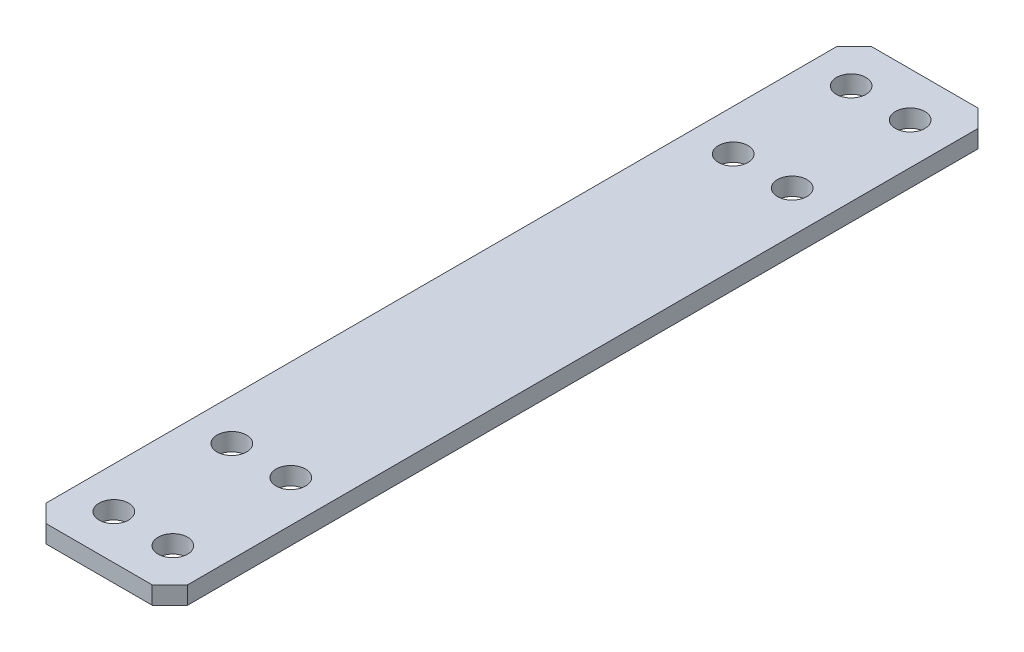
ISO-10303-21;
HEADER;
FILE_DESCRIPTION(('STEP AP214'),'2;1');
FILE_NAME('part.step','',(''),(''),'','','');
FILE_SCHEMA(('AUTOMOTIVE_DESIGN { 1 0 10303 214 1 1 1 1 }'));
ENDSEC;
DATA;
#1=APPLICATION_CONTEXT('core data for automotive mechanical design processes');
#2=APPLICATION_PROTOCOL_DEFINITION('international standard','automotive_design',2000,#1);
#3=PRODUCT_CONTEXT('',#1,'mechanical');
#4=PRODUCT('Part','Part','',(#3));
#5=PRODUCT_RELATED_PRODUCT_CATEGORY('part','',(#4));
#6=PRODUCT_DEFINITION_FORMATION('','',#4);
#7=PRODUCT_DEFINITION_CONTEXT('part definition',#1,'design');
#8=PRODUCT_DEFINITION('design','',#6,#7);
#9=PRODUCT_DEFINITION_SHAPE('','',#8);
#10=(LENGTH_UNIT() NAMED_UNIT(*) SI_UNIT(.MILLI.,.METRE.));
#11=(NAMED_UNIT(*) PLANE_ANGLE_UNIT() SI_UNIT($,.RADIAN.));
#12=(NAMED_UNIT(*) SI_UNIT($,.STERADIAN.) SOLID_ANGLE_UNIT());
#13=UNCERTAINTY_MEASURE_WITH_UNIT(LENGTH_MEASURE(1.E-05),#10,'distance_accuracy_value','');
#14=(GEOMETRIC_REPRESENTATION_CONTEXT(3) GLOBAL_UNCERTAINTY_ASSIGNED_CONTEXT((#13)) GLOBAL_UNIT_ASSIGNED_CONTEXT((#10,
#11,#12)) REPRESENTATION_CONTEXT('',''));
#15=CARTESIAN_POINT('',(0.,0.,0.));
#16=DIRECTION('',(0.,0.,1.));
#17=DIRECTION('',(1.,0.,0.));
#18=AXIS2_PLACEMENT_3D('',#15,#16,#17);
#19=CARTESIAN_POINT('',(-9.,0.,-70.));
#20=DIRECTION('',(-0.707106781186548,0.,-0.707106781186547));
#21=DIRECTION('',(-0.707106781186547,0.,0.707106781186548));
#22=AXIS2_PLACEMENT_3D('',#19,#20,#21);
#23=PLANE('',#22);
#24=DIRECTION('',(-0.707106781186547,0.,0.707106781186548));
#25=VECTOR('',#24,1.);
#26=CARTESIAN_POINT('',(-9.,3.,-70.));
#27=LINE('',#26,#25);
#28=CARTESIAN_POINT('',(-9.,3.,-70.));
#29=VERTEX_POINT('',#28);
#30=CARTESIAN_POINT('',(-12.,3.,-67.));
#31=VERTEX_POINT('',#30);
#32=EDGE_CURVE('E134',#29,#31,#27,.T.);
#33=ORIENTED_EDGE('',*,*,#32,.F.);
#34=DIRECTION('',(0.,1.,0.));
#35=VECTOR('',#34,1.);
#36=CARTESIAN_POINT('',(-9.,0.,-70.));
#37=LINE('',#36,#35);
#38=CARTESIAN_POINT('',(-9.,0.,-70.));
#39=VERTEX_POINT('',#38);
#40=EDGE_CURVE('E11',#39,#29,#37,.T.);
#41=ORIENTED_EDGE('',*,*,#40,.F.);
#42=DIRECTION('',(-0.707106781186547,0.,0.707106781186548));
#43=VECTOR('',#42,1.);
#44=CARTESIAN_POINT('',(-9.,0.,-70.));
#45=LINE('',#44,#43);
#46=CARTESIAN_POINT('',(-12.,0.,-67.));
#47=VERTEX_POINT('',#46);
#48=EDGE_CURVE('E155',#39,#47,#45,.T.);
#49=ORIENTED_EDGE('',*,*,#48,.T.);
#50=DIRECTION('',(0.,1.,0.));
#51=VECTOR('',#50,1.);
#52=CARTESIAN_POINT('',(-12.,0.,-67.));
#53=LINE('',#52,#51);
#54=EDGE_CURVE('E40',#47,#31,#53,.T.);
#55=ORIENTED_EDGE('',*,*,#54,.T.);
#56=EDGE_LOOP('',(#33,#41,#49,#55));
#57=FACE_BOUND('',#56,.T.);
#58=ADVANCED_FACE('F37',(#57),#23,.T.);
#59=CARTESIAN_POINT('',(9.,0.,-70.));
#60=DIRECTION('',(0.,0.,-1.));
#61=DIRECTION('',(-1.,0.,0.));
#62=AXIS2_PLACEMENT_3D('',#59,#60,#61);
#63=PLANE('',#62);
#64=DIRECTION('',(-1.,0.,0.));
#65=VECTOR('',#64,1.);
#66=CARTESIAN_POINT('',(9.,3.,-70.));
#67=LINE('',#66,#65);
#68=CARTESIAN_POINT('',(9.,3.,-70.));
#69=VERTEX_POINT('',#68);
#70=EDGE_CURVE('E153',#69,#29,#67,.T.);
#71=ORIENTED_EDGE('',*,*,#70,.F.);
#72=DIRECTION('',(0.,1.,0.));
#73=VECTOR('',#72,1.);
#74=CARTESIAN_POINT('',(9.,0.,-70.));
#75=LINE('',#74,#73);
#76=CARTESIAN_POINT('',(9.,0.,-70.));
#77=VERTEX_POINT('',#76);
#78=EDGE_CURVE('E46',#77,#69,#75,.T.);
#79=ORIENTED_EDGE('',*,*,#78,.F.);
#80=DIRECTION('',(-1.,0.,0.));
#81=VECTOR('',#80,1.);
#82=CARTESIAN_POINT('',(9.,0.,-70.));
#83=LINE('',#82,#81);
#84=EDGE_CURVE('E124',#77,#39,#83,.T.);
#85=ORIENTED_EDGE('',*,*,#84,.T.);
#86=ORIENTED_EDGE('',*,*,#40,.T.);
#87=EDGE_LOOP('',(#71,#79,#85,#86));
#88=FACE_BOUND('',#87,.T.);
#89=ADVANCED_FACE('F167',(#88),#63,.T.);
#90=CARTESIAN_POINT('',(12.,0.,-67.));
#91=DIRECTION('',(0.707106781186548,0.,-0.707106781186547));
#92=DIRECTION('',(-0.707106781186547,0.,-0.707106781186548));
#93=AXIS2_PLACEMENT_3D('',#90,#91,#92);
#94=PLANE('',#93);
#95=DIRECTION('',(-0.707106781186547,0.,-0.707106781186548));
#96=VECTOR('',#95,1.);
#97=CARTESIAN_POINT('',(12.,3.,-67.));
#98=LINE('',#97,#96);
#99=CARTESIAN_POINT('',(12.,3.,-67.));
#100=VERTEX_POINT('',#99);
#101=EDGE_CURVE('E111',#100,#69,#98,.T.);
#102=ORIENTED_EDGE('',*,*,#101,.F.);
#103=DIRECTION('',(0.,1.,0.));
#104=VECTOR('',#103,1.);
#105=CARTESIAN_POINT('',(12.,0.,-67.));
#106=LINE('',#105,#104);
#107=CARTESIAN_POINT('',(12.,0.,-67.));
#108=VERTEX_POINT('',#107);
#109=EDGE_CURVE('E106',#108,#100,#106,.T.);
#110=ORIENTED_EDGE('',*,*,#109,.F.);
#111=DIRECTION('',(-0.707106781186547,0.,-0.707106781186548));
#112=VECTOR('',#111,1.);
#113=CARTESIAN_POINT('',(12.,0.,-67.));
#114=LINE('',#113,#112);
#115=EDGE_CURVE('E109',#108,#77,#114,.T.);
#116=ORIENTED_EDGE('',*,*,#115,.T.);
#117=ORIENTED_EDGE('',*,*,#78,.T.);
#118=EDGE_LOOP('',(#102,#110,#116,#117));
#119=FACE_BOUND('',#118,.T.);
#120=ADVANCED_FACE('F108',(#119),#94,.T.);
#121=CARTESIAN_POINT('',(12.,0.,67.));
#122=DIRECTION('',(1.,0.,0.));
#123=DIRECTION('',(0.,0.,-1.));
#124=AXIS2_PLACEMENT_3D('',#121,#122,#123);
#125=PLANE('',#124);
#126=DIRECTION('',(0.,0.,-1.));
#127=VECTOR('',#126,1.);
#128=CARTESIAN_POINT('',(12.,3.,67.));
#129=LINE('',#128,#127);
#130=CARTESIAN_POINT('',(12.,3.,67.));
#131=VERTEX_POINT('',#130);
#132=EDGE_CURVE('E150',#131,#100,#129,.T.);
#133=ORIENTED_EDGE('',*,*,#132,.F.);
#134=DIRECTION('',(0.,1.,0.));
#135=VECTOR('',#134,1.);
#136=CARTESIAN_POINT('',(12.,0.,67.));
#137=LINE('',#136,#135);
#138=CARTESIAN_POINT('',(12.,0.,67.));
#139=VERTEX_POINT('',#138);
#140=EDGE_CURVE('E116',#139,#131,#137,.T.);
#141=ORIENTED_EDGE('',*,*,#140,.F.);
#142=DIRECTION('',(0.,0.,-1.));
#143=VECTOR('',#142,1.);
#144=CARTESIAN_POINT('',(12.,0.,67.));
#145=LINE('',#144,#143);
#146=EDGE_CURVE('E122',#139,#108,#145,.T.);
#147=ORIENTED_EDGE('',*,*,#146,.T.);
#148=ORIENTED_EDGE('',*,*,#109,.T.);
#149=EDGE_LOOP('',(#133,#141,#147,#148));
#150=FACE_BOUND('',#149,.T.);
#151=ADVANCED_FACE('F126',(#150),#125,.T.);
#152=CARTESIAN_POINT('',(9.,0.,70.));
#153=DIRECTION('',(0.707106781186548,0.,0.707106781186547));
#154=DIRECTION('',(0.707106781186547,0.,-0.707106781186548));
#155=AXIS2_PLACEMENT_3D('',#152,#153,#154);
#156=PLANE('',#155);
#157=DIRECTION('',(0.707106781186547,0.,-0.707106781186548));
#158=VECTOR('',#157,1.);
#159=CARTESIAN_POINT('',(9.,3.,70.));
#160=LINE('',#159,#158);
#161=CARTESIAN_POINT('',(9.,3.,70.));
#162=VERTEX_POINT('',#161);
#163=EDGE_CURVE('E147',#162,#131,#160,.T.);
#164=ORIENTED_EDGE('',*,*,#163,.F.);
#165=DIRECTION('',(0.,1.,0.));
#166=VECTOR('',#165,1.);
#167=CARTESIAN_POINT('',(9.,0.,70.));
#168=LINE('',#167,#166);
#169=CARTESIAN_POINT('',(9.,0.,70.));
#170=VERTEX_POINT('',#169);
#171=EDGE_CURVE('E159',#170,#162,#168,.T.);
#172=ORIENTED_EDGE('',*,*,#171,.F.);
#173=DIRECTION('',(0.707106781186547,0.,-0.707106781186548));
#174=VECTOR('',#173,1.);
#175=CARTESIAN_POINT('',(9.,0.,70.));
#176=LINE('',#175,#174);
#177=EDGE_CURVE('E127',#170,#139,#176,.T.);
#178=ORIENTED_EDGE('',*,*,#177,.T.);
#179=ORIENTED_EDGE('',*,*,#140,.T.);
#180=EDGE_LOOP('',(#164,#172,#178,#179));
#181=FACE_BOUND('',#180,.T.);
#182=ADVANCED_FACE('F180',(#181),#156,.T.);
#183=CARTESIAN_POINT('',(-9.,0.,70.));
#184=DIRECTION('',(0.,0.,1.));
#185=DIRECTION('',(1.,0.,0.));
#186=AXIS2_PLACEMENT_3D('',#183,#184,#185);
#187=PLANE('',#186);
#188=DIRECTION('',(1.,0.,0.));
#189=VECTOR('',#188,1.);
#190=CARTESIAN_POINT('',(-9.,3.,70.));
#191=LINE('',#190,#189);
#192=CARTESIAN_POINT('',(-9.,3.,70.));
#193=VERTEX_POINT('',#192);
#194=EDGE_CURVE('E144',#193,#162,#191,.T.);
#195=ORIENTED_EDGE('',*,*,#194,.F.);
#196=DIRECTION('',(0.,1.,0.));
#197=VECTOR('',#196,1.);
#198=CARTESIAN_POINT('',(-9.,0.,70.));
#199=LINE('',#198,#197);
#200=CARTESIAN_POINT('',(-9.,0.,70.));
#201=VERTEX_POINT('',#200);
#202=EDGE_CURVE('E161',#201,#193,#199,.T.);
#203=ORIENTED_EDGE('',*,*,#202,.F.);
#204=DIRECTION('',(1.,0.,0.));
#205=VECTOR('',#204,1.);
#206=CARTESIAN_POINT('',(-9.,0.,70.));
#207=LINE('',#206,#205);
#208=EDGE_CURVE('E129',#201,#170,#207,.T.);
#209=ORIENTED_EDGE('',*,*,#208,.T.);
#210=ORIENTED_EDGE('',*,*,#171,.T.);
#211=EDGE_LOOP('',(#195,#203,#209,#210));
#212=FACE_BOUND('',#211,.T.);
#213=ADVANCED_FACE('F183',(#212),#187,.T.);
#214=CARTESIAN_POINT('',(-12.,0.,67.));
#215=DIRECTION('',(-0.707106781186548,0.,0.707106781186547));
#216=DIRECTION('',(0.707106781186547,0.,0.707106781186548));
#217=AXIS2_PLACEMENT_3D('',#214,#215,#216);
#218=PLANE('',#217);
#219=DIRECTION('',(0.707106781186547,0.,0.707106781186548));
#220=VECTOR('',#219,1.);
#221=CARTESIAN_POINT('',(-12.,3.,67.));
#222=LINE('',#221,#220);
#223=CARTESIAN_POINT('',(-12.,3.,67.));
#224=VERTEX_POINT('',#223);
#225=EDGE_CURVE('E141',#224,#193,#222,.T.);
#226=ORIENTED_EDGE('',*,*,#225,.F.);
#227=DIRECTION('',(0.,1.,0.));
#228=VECTOR('',#227,1.);
#229=CARTESIAN_POINT('',(-12.,0.,67.));
#230=LINE('',#229,#228);
#231=CARTESIAN_POINT('',(-12.,0.,67.));
#232=VERTEX_POINT('',#231);
#233=EDGE_CURVE('E162',#232,#224,#230,.T.);
#234=ORIENTED_EDGE('',*,*,#233,.F.);
#235=DIRECTION('',(0.707106781186547,0.,0.707106781186548));
#236=VECTOR('',#235,1.);
#237=CARTESIAN_POINT('',(-12.,0.,67.));
#238=LINE('',#237,#236);
#239=EDGE_CURVE('E289',#232,#201,#238,.T.);
#240=ORIENTED_EDGE('',*,*,#239,.T.);
#241=ORIENTED_EDGE('',*,*,#202,.T.);
#242=EDGE_LOOP('',(#226,#234,#240,#241));
#243=FACE_BOUND('',#242,.T.);
#244=ADVANCED_FACE('F187',(#243),#218,.T.);
#245=CARTESIAN_POINT('',(-12.,0.,-67.));
#246=DIRECTION('',(-1.,0.,0.));
#247=DIRECTION('',(0.,0.,1.));
#248=AXIS2_PLACEMENT_3D('',#245,#246,#247);
#249=PLANE('',#248);
#250=DIRECTION('',(0.,0.,1.));
#251=VECTOR('',#250,1.);
#252=CARTESIAN_POINT('',(-12.,3.,-67.));
#253=LINE('',#252,#251);
#254=EDGE_CURVE('E137',#31,#224,#253,.T.);
#255=ORIENTED_EDGE('',*,*,#254,.F.);
#256=ORIENTED_EDGE('',*,*,#54,.F.);
#257=DIRECTION('',(0.,0.,1.));
#258=VECTOR('',#257,1.);
#259=CARTESIAN_POINT('',(-12.,0.,-67.));
#260=LINE('',#259,#258);
#261=EDGE_CURVE('E287',#47,#232,#260,.T.);
#262=ORIENTED_EDGE('',*,*,#261,.T.);
#263=ORIENTED_EDGE('',*,*,#233,.T.);
#264=EDGE_LOOP('',(#255,#256,#262,#263));
#265=FACE_BOUND('',#264,.T.);
#266=ADVANCED_FACE('F164',(#265),#249,.T.);
#267=CARTESIAN_POINT('',(0.,0.,0.));
#268=DIRECTION('',(0.,1.,0.));
#269=DIRECTION('',(0.,0.,1.));
#270=AXIS2_PLACEMENT_3D('',#267,#268,#269);
#271=PLANE('',#270);
#272=CARTESIAN_POINT('',(-5.,0.,62.5));
#273=DIRECTION('',(0.,1.,0.));
#274=DIRECTION('',(0.,0.,-1.));
#275=AXIS2_PLACEMENT_3D('',#272,#273,#274);
#276=CIRCLE('',#275,2.5);
#277=CARTESIAN_POINT('',(-5.,0.,60.));
#278=VERTEX_POINT('',#277);
#279=EDGE_CURVE('E238',#278,#278,#276,.T.);
#280=ORIENTED_EDGE('',*,*,#279,.T.);
#281=EDGE_LOOP('',(#280));
#282=FACE_BOUND('',#281,.T.);
#283=CARTESIAN_POINT('',(5.,0.,62.5));
#284=DIRECTION('',(0.,1.,0.));
#285=DIRECTION('',(0.,0.,-1.));
#286=AXIS2_PLACEMENT_3D('',#283,#284,#285);
#287=CIRCLE('',#286,2.5);
#288=CARTESIAN_POINT('',(5.,0.,60.));
#289=VERTEX_POINT('',#288);
#290=EDGE_CURVE('E246',#289,#289,#287,.T.);
#291=ORIENTED_EDGE('',*,*,#290,.T.);
#292=EDGE_LOOP('',(#291));
#293=FACE_BOUND('',#292,.T.);
#294=CARTESIAN_POINT('',(-4.99999999999891,0.,42.5));
#295=DIRECTION('',(0.,1.,0.));
#296=DIRECTION('',(0.,0.,-1.));
#297=AXIS2_PLACEMENT_3D('',#294,#295,#296);
#298=CIRCLE('',#297,2.5);
#299=CARTESIAN_POINT('',(-4.99999999999891,0.,40.));
#300=VERTEX_POINT('',#299);
#301=EDGE_CURVE('E252',#300,#300,#298,.T.);
#302=ORIENTED_EDGE('',*,*,#301,.T.);
#303=EDGE_LOOP('',(#302));
#304=FACE_BOUND('',#303,.T.);
#305=CARTESIAN_POINT('',(5.00000000000109,0.,42.5));
#306=DIRECTION('',(0.,1.,0.));
#307=DIRECTION('',(0.,0.,-1.));
#308=AXIS2_PLACEMENT_3D('',#305,#306,#307);
#309=CIRCLE('',#308,2.5);
#310=CARTESIAN_POINT('',(5.00000000000109,0.,40.));
#311=VERTEX_POINT('',#310);
#312=EDGE_CURVE('E258',#311,#311,#309,.T.);
#313=ORIENTED_EDGE('',*,*,#312,.T.);
#314=EDGE_LOOP('',(#313));
#315=FACE_BOUND('',#314,.T.);
#316=CARTESIAN_POINT('',(-5.,0.,-42.5));
#317=DIRECTION('',(0.,1.,0.));
#318=DIRECTION('',(0.,0.,-1.));
#319=AXIS2_PLACEMENT_3D('',#316,#317,#318);
#320=CIRCLE('',#319,2.5);
#321=CARTESIAN_POINT('',(-5.,0.,-45.));
#322=VERTEX_POINT('',#321);
#323=EDGE_CURVE('E264',#322,#322,#320,.T.);
#324=ORIENTED_EDGE('',*,*,#323,.T.);
#325=EDGE_LOOP('',(#324));
#326=FACE_BOUND('',#325,.T.);
#327=CARTESIAN_POINT('',(5.,0.,-42.5));
#328=DIRECTION('',(0.,1.,0.));
#329=DIRECTION('',(0.,0.,-1.));
#330=AXIS2_PLACEMENT_3D('',#327,#328,#329);
#331=CIRCLE('',#330,2.5);
#332=CARTESIAN_POINT('',(5.,0.,-45.));
#333=VERTEX_POINT('',#332);
#334=EDGE_CURVE('E270',#333,#333,#331,.T.);
#335=ORIENTED_EDGE('',*,*,#334,.T.);
#336=EDGE_LOOP('',(#335));
#337=FACE_BOUND('',#336,.T.);
#338=CARTESIAN_POINT('',(5.,0.,-62.5));
#339=DIRECTION('',(0.,1.,0.));
#340=DIRECTION('',(0.,0.,-1.));
#341=AXIS2_PLACEMENT_3D('',#338,#339,#340);
#342=CIRCLE('',#341,2.5);
#343=CARTESIAN_POINT('',(5.,0.,-65.));
#344=VERTEX_POINT('',#343);
#345=EDGE_CURVE('E276',#344,#344,#342,.T.);
#346=ORIENTED_EDGE('',*,*,#345,.T.);
#347=EDGE_LOOP('',(#346));
#348=FACE_BOUND('',#347,.T.);
#349=CARTESIAN_POINT('',(-5.,0.,-62.5));
#350=DIRECTION('',(0.,1.,0.));
#351=DIRECTION('',(0.,0.,-1.));
#352=AXIS2_PLACEMENT_3D('',#349,#350,#351);
#353=CIRCLE('',#352,2.5);
#354=CARTESIAN_POINT('',(-5.,0.,-65.));
#355=VERTEX_POINT('',#354);
#356=EDGE_CURVE('E138',#355,#355,#353,.T.);
#357=ORIENTED_EDGE('',*,*,#356,.T.);
#358=EDGE_LOOP('',(#357));
#359=FACE_BOUND('',#358,.T.);
#360=ORIENTED_EDGE('',*,*,#48,.F.);
#361=ORIENTED_EDGE('',*,*,#84,.F.);
#362=ORIENTED_EDGE('',*,*,#115,.F.);
#363=ORIENTED_EDGE('',*,*,#146,.F.);
#364=ORIENTED_EDGE('',*,*,#177,.F.);
#365=ORIENTED_EDGE('',*,*,#208,.F.);
#366=ORIENTED_EDGE('',*,*,#239,.F.);
#367=ORIENTED_EDGE('',*,*,#261,.F.);
#368=EDGE_LOOP('',(#360,#361,#362,#363,#364,#365,#366,#367));
#369=FACE_BOUND('',#368,.T.);
#370=ADVANCED_FACE('F120',(#282,#293,#304,#315,#326,#337,#348,#359,#369),#271,.F.);
#371=CARTESIAN_POINT('',(0.,3.,0.));
#372=DIRECTION('',(0.,1.,0.));
#373=DIRECTION('',(0.,0.,1.));
#374=AXIS2_PLACEMENT_3D('',#371,#372,#373);
#375=PLANE('',#374);
#376=CARTESIAN_POINT('',(-5.,3.,62.5));
#377=DIRECTION('',(0.,1.,0.));
#378=DIRECTION('',(0.,0.,-1.));
#379=AXIS2_PLACEMENT_3D('',#376,#377,#378);
#380=CIRCLE('',#379,2.5);
#381=CARTESIAN_POINT('',(-5.,3.,60.));
#382=VERTEX_POINT('',#381);
#383=EDGE_CURVE('E241',#382,#382,#380,.T.);
#384=ORIENTED_EDGE('',*,*,#383,.F.);
#385=EDGE_LOOP('',(#384));
#386=FACE_BOUND('',#385,.T.);
#387=CARTESIAN_POINT('',(5.,3.,62.5));
#388=DIRECTION('',(0.,1.,0.));
#389=DIRECTION('',(0.,0.,-1.));
#390=AXIS2_PLACEMENT_3D('',#387,#388,#389);
#391=CIRCLE('',#390,2.5);
#392=CARTESIAN_POINT('',(5.,3.,60.));
#393=VERTEX_POINT('',#392);
#394=EDGE_CURVE('E243',#393,#393,#391,.T.);
#395=ORIENTED_EDGE('',*,*,#394,.F.);
#396=EDGE_LOOP('',(#395));
#397=FACE_BOUND('',#396,.T.);
#398=CARTESIAN_POINT('',(-4.99999999999891,3.,42.5));
#399=DIRECTION('',(0.,1.,0.));
#400=DIRECTION('',(0.,0.,-1.));
#401=AXIS2_PLACEMENT_3D('',#398,#399,#400);
#402=CIRCLE('',#401,2.5);
#403=CARTESIAN_POINT('',(-4.99999999999891,3.,40.));
#404=VERTEX_POINT('',#403);
#405=EDGE_CURVE('E249',#404,#404,#402,.T.);
#406=ORIENTED_EDGE('',*,*,#405,.F.);
#407=EDGE_LOOP('',(#406));
#408=FACE_BOUND('',#407,.T.);
#409=CARTESIAN_POINT('',(5.00000000000109,3.,42.5));
#410=DIRECTION('',(0.,1.,0.));
#411=DIRECTION('',(0.,0.,-1.));
#412=AXIS2_PLACEMENT_3D('',#409,#410,#411);
#413=CIRCLE('',#412,2.5);
#414=CARTESIAN_POINT('',(5.00000000000109,3.,40.));
#415=VERTEX_POINT('',#414);
#416=EDGE_CURVE('E255',#415,#415,#413,.T.);
#417=ORIENTED_EDGE('',*,*,#416,.F.);
#418=EDGE_LOOP('',(#417));
#419=FACE_BOUND('',#418,.T.);
#420=CARTESIAN_POINT('',(-5.,3.,-42.5));
#421=DIRECTION('',(0.,1.,0.));
#422=DIRECTION('',(0.,0.,-1.));
#423=AXIS2_PLACEMENT_3D('',#420,#421,#422);
#424=CIRCLE('',#423,2.5);
#425=CARTESIAN_POINT('',(-5.,3.,-45.));
#426=VERTEX_POINT('',#425);
#427=EDGE_CURVE('E261',#426,#426,#424,.T.);
#428=ORIENTED_EDGE('',*,*,#427,.F.);
#429=EDGE_LOOP('',(#428));
#430=FACE_BOUND('',#429,.T.);
#431=CARTESIAN_POINT('',(5.,3.,-42.5));
#432=DIRECTION('',(0.,1.,0.));
#433=DIRECTION('',(0.,0.,-1.));
#434=AXIS2_PLACEMENT_3D('',#431,#432,#433);
#435=CIRCLE('',#434,2.5);
#436=CARTESIAN_POINT('',(5.,3.,-45.));
#437=VERTEX_POINT('',#436);
#438=EDGE_CURVE('E267',#437,#437,#435,.T.);
#439=ORIENTED_EDGE('',*,*,#438,.F.);
#440=EDGE_LOOP('',(#439));
#441=FACE_BOUND('',#440,.T.);
#442=CARTESIAN_POINT('',(5.,3.,-62.5));
#443=DIRECTION('',(0.,1.,0.));
#444=DIRECTION('',(0.,0.,-1.));
#445=AXIS2_PLACEMENT_3D('',#442,#443,#444);
#446=CIRCLE('',#445,2.5);
#447=CARTESIAN_POINT('',(5.,3.,-65.));
#448=VERTEX_POINT('',#447);
#449=EDGE_CURVE('E273',#448,#448,#446,.T.);
#450=ORIENTED_EDGE('',*,*,#449,.F.);
#451=EDGE_LOOP('',(#450));
#452=FACE_BOUND('',#451,.T.);
#453=CARTESIAN_POINT('',(-5.,3.,-62.5));
#454=DIRECTION('',(0.,1.,0.));
#455=DIRECTION('',(0.,0.,-1.));
#456=AXIS2_PLACEMENT_3D('',#453,#454,#455);
#457=CIRCLE('',#456,2.5);
#458=CARTESIAN_POINT('',(-5.,3.,-65.));
#459=VERTEX_POINT('',#458);
#460=EDGE_CURVE('E279',#459,#459,#457,.T.);
#461=ORIENTED_EDGE('',*,*,#460,.F.);
#462=EDGE_LOOP('',(#461));
#463=FACE_BOUND('',#462,.T.);
#464=ORIENTED_EDGE('',*,*,#32,.T.);
#465=ORIENTED_EDGE('',*,*,#254,.T.);
#466=ORIENTED_EDGE('',*,*,#225,.T.);
#467=ORIENTED_EDGE('',*,*,#194,.T.);
#468=ORIENTED_EDGE('',*,*,#163,.T.);
#469=ORIENTED_EDGE('',*,*,#132,.T.);
#470=ORIENTED_EDGE('',*,*,#101,.T.);
#471=ORIENTED_EDGE('',*,*,#70,.T.);
#472=EDGE_LOOP('',(#464,#465,#466,#467,#468,#469,#470,#471));
#473=FACE_BOUND('',#472,.T.);
#474=ADVANCED_FACE('F166',(#386,#397,#408,#419,#430,#441,#452,#463,#473),#375,.T.);
#475=CARTESIAN_POINT('',(-5.,0.,-62.5));
#476=DIRECTION('',(0.,1.,0.));
#477=DIRECTION('',(0.,0.,1.));
#478=AXIS2_PLACEMENT_3D('',#475,#476,#477);
#479=CYLINDRICAL_SURFACE('',#478,2.5);
#480=ORIENTED_EDGE('',*,*,#356,.F.);
#481=EDGE_LOOP('',(#480));
#482=FACE_BOUND('',#481,.T.);
#483=ORIENTED_EDGE('',*,*,#460,.T.);
#484=EDGE_LOOP('',(#483));
#485=FACE_BOUND('',#484,.T.);
#486=ADVANCED_FACE('F199',(#482,#485),#479,.F.);
#487=CARTESIAN_POINT('',(5.,0.,-62.5));
#488=DIRECTION('',(0.,1.,0.));
#489=DIRECTION('',(0.,0.,1.));
#490=AXIS2_PLACEMENT_3D('',#487,#488,#489);
#491=CYLINDRICAL_SURFACE('',#490,2.5);
#492=ORIENTED_EDGE('',*,*,#345,.F.);
#493=EDGE_LOOP('',(#492));
#494=FACE_BOUND('',#493,.T.);
#495=ORIENTED_EDGE('',*,*,#449,.T.);
#496=EDGE_LOOP('',(#495));
#497=FACE_BOUND('',#496,.T.);
#498=ADVANCED_FACE('F206',(#494,#497),#491,.F.);
#499=CARTESIAN_POINT('',(5.,0.,-42.5));
#500=DIRECTION('',(0.,1.,0.));
#501=DIRECTION('',(0.,0.,1.));
#502=AXIS2_PLACEMENT_3D('',#499,#500,#501);
#503=CYLINDRICAL_SURFACE('',#502,2.5);
#504=ORIENTED_EDGE('',*,*,#334,.F.);
#505=EDGE_LOOP('',(#504));
#506=FACE_BOUND('',#505,.T.);
#507=ORIENTED_EDGE('',*,*,#438,.T.);
#508=EDGE_LOOP('',(#507));
#509=FACE_BOUND('',#508,.T.);
#510=ADVANCED_FACE('F210',(#506,#509),#503,.F.);
#511=CARTESIAN_POINT('',(-5.,0.,-42.5));
#512=DIRECTION('',(0.,1.,0.));
#513=DIRECTION('',(0.,0.,1.));
#514=AXIS2_PLACEMENT_3D('',#511,#512,#513);
#515=CYLINDRICAL_SURFACE('',#514,2.5);
#516=ORIENTED_EDGE('',*,*,#323,.F.);
#517=EDGE_LOOP('',(#516));
#518=FACE_BOUND('',#517,.T.);
#519=ORIENTED_EDGE('',*,*,#427,.T.);
#520=EDGE_LOOP('',(#519));
#521=FACE_BOUND('',#520,.T.);
#522=ADVANCED_FACE('F214',(#518,#521),#515,.F.);
#523=CARTESIAN_POINT('',(5.00000000000109,0.,42.5));
#524=DIRECTION('',(0.,1.,0.));
#525=DIRECTION('',(0.,0.,1.));
#526=AXIS2_PLACEMENT_3D('',#523,#524,#525);
#527=CYLINDRICAL_SURFACE('',#526,2.5);
#528=ORIENTED_EDGE('',*,*,#312,.F.);
#529=EDGE_LOOP('',(#528));
#530=FACE_BOUND('',#529,.T.);
#531=ORIENTED_EDGE('',*,*,#416,.T.);
#532=EDGE_LOOP('',(#531));
#533=FACE_BOUND('',#532,.T.);
#534=ADVANCED_FACE('F218',(#530,#533),#527,.F.);
#535=CARTESIAN_POINT('',(-4.99999999999891,0.,42.5));
#536=DIRECTION('',(0.,1.,0.));
#537=DIRECTION('',(0.,0.,1.));
#538=AXIS2_PLACEMENT_3D('',#535,#536,#537);
#539=CYLINDRICAL_SURFACE('',#538,2.5);
#540=ORIENTED_EDGE('',*,*,#301,.F.);
#541=EDGE_LOOP('',(#540));
#542=FACE_BOUND('',#541,.T.);
#543=ORIENTED_EDGE('',*,*,#405,.T.);
#544=EDGE_LOOP('',(#543));
#545=FACE_BOUND('',#544,.T.);
#546=ADVANCED_FACE('F222',(#542,#545),#539,.F.);
#547=CARTESIAN_POINT('',(5.,0.,62.5));
#548=DIRECTION('',(0.,1.,0.));
#549=DIRECTION('',(0.,0.,1.));
#550=AXIS2_PLACEMENT_3D('',#547,#548,#549);
#551=CYLINDRICAL_SURFACE('',#550,2.5);
#552=ORIENTED_EDGE('',*,*,#290,.F.);
#553=EDGE_LOOP('',(#552));
#554=FACE_BOUND('',#553,.T.);
#555=ORIENTED_EDGE('',*,*,#394,.T.);
#556=EDGE_LOOP('',(#555));
#557=FACE_BOUND('',#556,.T.);
#558=ADVANCED_FACE('F226',(#554,#557),#551,.F.);
#559=CARTESIAN_POINT('',(-5.,0.,62.5));
#560=DIRECTION('',(0.,1.,0.));
#561=DIRECTION('',(0.,0.,1.));
#562=AXIS2_PLACEMENT_3D('',#559,#560,#561);
#563=CYLINDRICAL_SURFACE('',#562,2.5);
#564=ORIENTED_EDGE('',*,*,#279,.F.);
#565=EDGE_LOOP('',(#564));
#566=FACE_BOUND('',#565,.T.);
#567=ORIENTED_EDGE('',*,*,#383,.T.);
#568=EDGE_LOOP('',(#567));
#569=FACE_BOUND('',#568,.T.);
#570=ADVANCED_FACE('F230',(#566,#569),#563,.F.);
#571=CLOSED_SHELL('',(#58,#89,#120,#151,#182,#213,#244,#266,#370,#474,#486,#498,#510,#522,#534,
#546,#558,#570));
#572=MANIFOLD_SOLID_BREP('B2',#571);
#573=ADVANCED_BREP_SHAPE_REPRESENTATION('',(#18,#572),#14);
#574=SHAPE_DEFINITION_REPRESENTATION(#9,#573);
ENDSEC;
END-ISO-10303-21;
